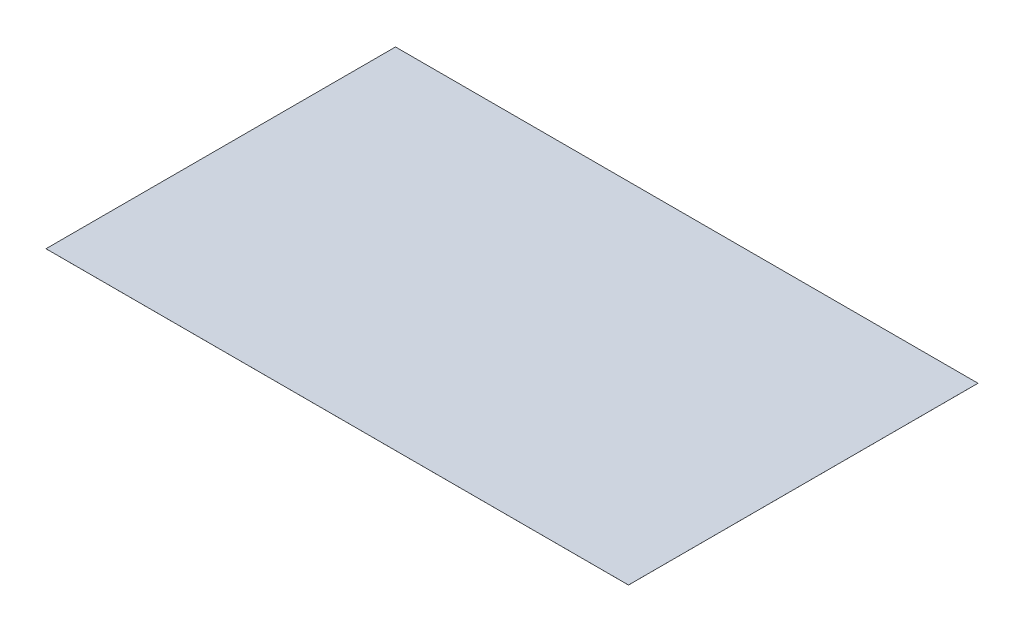
ISO-10303-21;
HEADER;
FILE_DESCRIPTION(('STEP AP214'),'2;1');
FILE_NAME('part.step','',(''),(''),'','','');
FILE_SCHEMA(('AUTOMOTIVE_DESIGN { 1 0 10303 214 1 1 1 1 }'));
ENDSEC;
DATA;
#1=APPLICATION_CONTEXT('core data for automotive mechanical design processes');
#2=APPLICATION_PROTOCOL_DEFINITION('international standard','automotive_design',2000,#1);
#3=PRODUCT_CONTEXT('',#1,'mechanical');
#4=PRODUCT('Part','Part','',(#3));
#5=PRODUCT_RELATED_PRODUCT_CATEGORY('part','',(#4));
#6=PRODUCT_DEFINITION_FORMATION('','',#4);
#7=PRODUCT_DEFINITION_CONTEXT('part definition',#1,'design');
#8=PRODUCT_DEFINITION('design','',#6,#7);
#9=PRODUCT_DEFINITION_SHAPE('','',#8);
#10=(LENGTH_UNIT() NAMED_UNIT(*) SI_UNIT(.MILLI.,.METRE.));
#11=(NAMED_UNIT(*) PLANE_ANGLE_UNIT() SI_UNIT($,.RADIAN.));
#12=(NAMED_UNIT(*) SI_UNIT($,.STERADIAN.) SOLID_ANGLE_UNIT());
#13=UNCERTAINTY_MEASURE_WITH_UNIT(LENGTH_MEASURE(1.E-05),#10,'distance_accuracy_value','');
#14=(GEOMETRIC_REPRESENTATION_CONTEXT(3) GLOBAL_UNCERTAINTY_ASSIGNED_CONTEXT((#13)) GLOBAL_UNIT_ASSIGNED_CONTEXT((#10,
#11,#12)) REPRESENTATION_CONTEXT('',''));
#15=CARTESIAN_POINT('',(0.,0.,0.));
#16=DIRECTION('',(0.,0.,1.));
#17=DIRECTION('',(1.,0.,0.));
#18=AXIS2_PLACEMENT_3D('',#15,#16,#17);
#19=CARTESIAN_POINT('',(12500.,1.,-7500.));
#20=DIRECTION('',(-1.,0.,0.));
#21=DIRECTION('',(0.,0.,1.));
#22=AXIS2_PLACEMENT_3D('',#19,#20,#21);
#23=PLANE('',#22);
#24=DIRECTION('',(0.,0.,-1.));
#25=VECTOR('',#24,1.);
#26=CARTESIAN_POINT('',(12500.,0.,-7500.));
#27=LINE('',#26,#25);
#28=CARTESIAN_POINT('',(12500.,0.,7500.));
#29=VERTEX_POINT('',#28);
#30=CARTESIAN_POINT('',(12500.,0.,-7500.));
#31=VERTEX_POINT('',#30);
#32=EDGE_CURVE('E98',#29,#31,#27,.T.);
#33=ORIENTED_EDGE('',*,*,#32,.T.);
#34=DIRECTION('',(0.,-1.,0.));
#35=VECTOR('',#34,1.);
#36=CARTESIAN_POINT('',(12500.,1.,-7500.));
#37=LINE('',#36,#35);
#38=CARTESIAN_POINT('',(12500.,1.,-7500.));
#39=VERTEX_POINT('',#38);
#40=EDGE_CURVE('E11',#39,#31,#37,.T.);
#41=ORIENTED_EDGE('',*,*,#40,.F.);
#42=DIRECTION('',(0.,0.,-1.));
#43=VECTOR('',#42,1.);
#44=CARTESIAN_POINT('',(12500.,1.,-7500.));
#45=LINE('',#44,#43);
#46=CARTESIAN_POINT('',(12500.,1.,7500.));
#47=VERTEX_POINT('',#46);
#48=EDGE_CURVE('E86',#47,#39,#45,.T.);
#49=ORIENTED_EDGE('',*,*,#48,.F.);
#50=DIRECTION('',(0.,-1.,0.));
#51=VECTOR('',#50,1.);
#52=CARTESIAN_POINT('',(12500.,1.,7500.));
#53=LINE('',#52,#51);
#54=EDGE_CURVE('E94',#47,#29,#53,.T.);
#55=ORIENTED_EDGE('',*,*,#54,.T.);
#56=EDGE_LOOP('',(#33,#41,#49,#55));
#57=FACE_BOUND('',#56,.T.);
#58=ADVANCED_FACE('F35',(#57),#23,.F.);
#59=CARTESIAN_POINT('',(-12500.,1.,-7500.));
#60=DIRECTION('',(0.,0.,1.));
#61=DIRECTION('',(1.,0.,0.));
#62=AXIS2_PLACEMENT_3D('',#59,#60,#61);
#63=PLANE('',#62);
#64=DIRECTION('',(-1.,0.,0.));
#65=VECTOR('',#64,1.);
#66=CARTESIAN_POINT('',(-12500.,0.,-7500.));
#67=LINE('',#66,#65);
#68=CARTESIAN_POINT('',(-12500.,0.,-7500.));
#69=VERTEX_POINT('',#68);
#70=EDGE_CURVE('E90',#31,#69,#67,.T.);
#71=ORIENTED_EDGE('',*,*,#70,.T.);
#72=DIRECTION('',(0.,-1.,0.));
#73=VECTOR('',#72,1.);
#74=CARTESIAN_POINT('',(-12500.,1.,-7500.));
#75=LINE('',#74,#73);
#76=CARTESIAN_POINT('',(-12500.,1.,-7500.));
#77=VERTEX_POINT('',#76);
#78=EDGE_CURVE('E43',#77,#69,#75,.T.);
#79=ORIENTED_EDGE('',*,*,#78,.F.);
#80=DIRECTION('',(-1.,0.,0.));
#81=VECTOR('',#80,1.);
#82=CARTESIAN_POINT('',(-12500.,1.,-7500.));
#83=LINE('',#82,#81);
#84=EDGE_CURVE('E81',#39,#77,#83,.T.);
#85=ORIENTED_EDGE('',*,*,#84,.F.);
#86=ORIENTED_EDGE('',*,*,#40,.T.);
#87=EDGE_LOOP('',(#71,#79,#85,#86));
#88=FACE_BOUND('',#87,.T.);
#89=ADVANCED_FACE('F89',(#88),#63,.F.);
#90=CARTESIAN_POINT('',(-12500.,1.,-7500.));
#91=DIRECTION('',(1.,0.,0.));
#92=DIRECTION('',(0.,0.,-1.));
#93=AXIS2_PLACEMENT_3D('',#90,#91,#92);
#94=PLANE('',#93);
#95=DIRECTION('',(0.,0.,1.));
#96=VECTOR('',#95,1.);
#97=CARTESIAN_POINT('',(-12500.,0.,-7500.));
#98=LINE('',#97,#96);
#99=CARTESIAN_POINT('',(-12500.,0.,7500.));
#100=VERTEX_POINT('',#99);
#101=EDGE_CURVE('E68',#69,#100,#98,.T.);
#102=ORIENTED_EDGE('',*,*,#101,.T.);
#103=DIRECTION('',(0.,-1.,0.));
#104=VECTOR('',#103,1.);
#105=CARTESIAN_POINT('',(-12500.,1.,7500.));
#106=LINE('',#105,#104);
#107=CARTESIAN_POINT('',(-12500.,1.,7500.));
#108=VERTEX_POINT('',#107);
#109=EDGE_CURVE('E91',#108,#100,#106,.T.);
#110=ORIENTED_EDGE('',*,*,#109,.F.);
#111=DIRECTION('',(0.,0.,1.));
#112=VECTOR('',#111,1.);
#113=CARTESIAN_POINT('',(-12500.,1.,-7500.));
#114=LINE('',#113,#112);
#115=EDGE_CURVE('E84',#77,#108,#114,.T.);
#116=ORIENTED_EDGE('',*,*,#115,.F.);
#117=ORIENTED_EDGE('',*,*,#78,.T.);
#118=EDGE_LOOP('',(#102,#110,#116,#117));
#119=FACE_BOUND('',#118,.T.);
#120=ADVANCED_FACE('F92',(#119),#94,.F.);
#121=CARTESIAN_POINT('',(-12500.,1.,7500.));
#122=DIRECTION('',(0.,0.,-1.));
#123=DIRECTION('',(-1.,0.,0.));
#124=AXIS2_PLACEMENT_3D('',#121,#122,#123);
#125=PLANE('',#124);
#126=DIRECTION('',(1.,0.,0.));
#127=VECTOR('',#126,1.);
#128=CARTESIAN_POINT('',(-12500.,0.,7500.));
#129=LINE('',#128,#127);
#130=EDGE_CURVE('E74',#100,#29,#129,.T.);
#131=ORIENTED_EDGE('',*,*,#130,.T.);
#132=ORIENTED_EDGE('',*,*,#54,.F.);
#133=DIRECTION('',(1.,0.,0.));
#134=VECTOR('',#133,1.);
#135=CARTESIAN_POINT('',(-12500.,1.,7500.));
#136=LINE('',#135,#134);
#137=EDGE_CURVE('E51',#108,#47,#136,.T.);
#138=ORIENTED_EDGE('',*,*,#137,.F.);
#139=ORIENTED_EDGE('',*,*,#109,.T.);
#140=EDGE_LOOP('',(#131,#132,#138,#139));
#141=FACE_BOUND('',#140,.T.);
#142=ADVANCED_FACE('F105',(#141),#125,.F.);
#143=CARTESIAN_POINT('',(0.,1.,0.));
#144=DIRECTION('',(0.,1.,0.));
#145=DIRECTION('',(0.,0.,1.));
#146=AXIS2_PLACEMENT_3D('',#143,#144,#145);
#147=PLANE('',#146);
#148=ORIENTED_EDGE('',*,*,#48,.T.);
#149=ORIENTED_EDGE('',*,*,#84,.T.);
#150=ORIENTED_EDGE('',*,*,#115,.T.);
#151=ORIENTED_EDGE('',*,*,#137,.T.);
#152=EDGE_LOOP('',(#148,#149,#150,#151));
#153=FACE_BOUND('',#152,.T.);
#154=ADVANCED_FACE('F82',(#153),#147,.T.);
#155=CARTESIAN_POINT('',(0.,0.,0.));
#156=DIRECTION('',(0.,1.,0.));
#157=DIRECTION('',(0.,0.,1.));
#158=AXIS2_PLACEMENT_3D('',#155,#156,#157);
#159=PLANE('',#158);
#160=ORIENTED_EDGE('',*,*,#32,.F.);
#161=ORIENTED_EDGE('',*,*,#130,.F.);
#162=ORIENTED_EDGE('',*,*,#101,.F.);
#163=ORIENTED_EDGE('',*,*,#70,.F.);
#164=EDGE_LOOP('',(#160,#161,#162,#163));
#165=FACE_BOUND('',#164,.T.);
#166=ADVANCED_FACE('F108',(#165),#159,.F.);
#167=CLOSED_SHELL('',(#58,#89,#120,#142,#154,#166));
#168=MANIFOLD_SOLID_BREP('B2',#167);
#169=ADVANCED_BREP_SHAPE_REPRESENTATION('',(#18,#168),#14);
#170=SHAPE_DEFINITION_REPRESENTATION(#9,#169);
ENDSEC;
END-ISO-10303-21;
